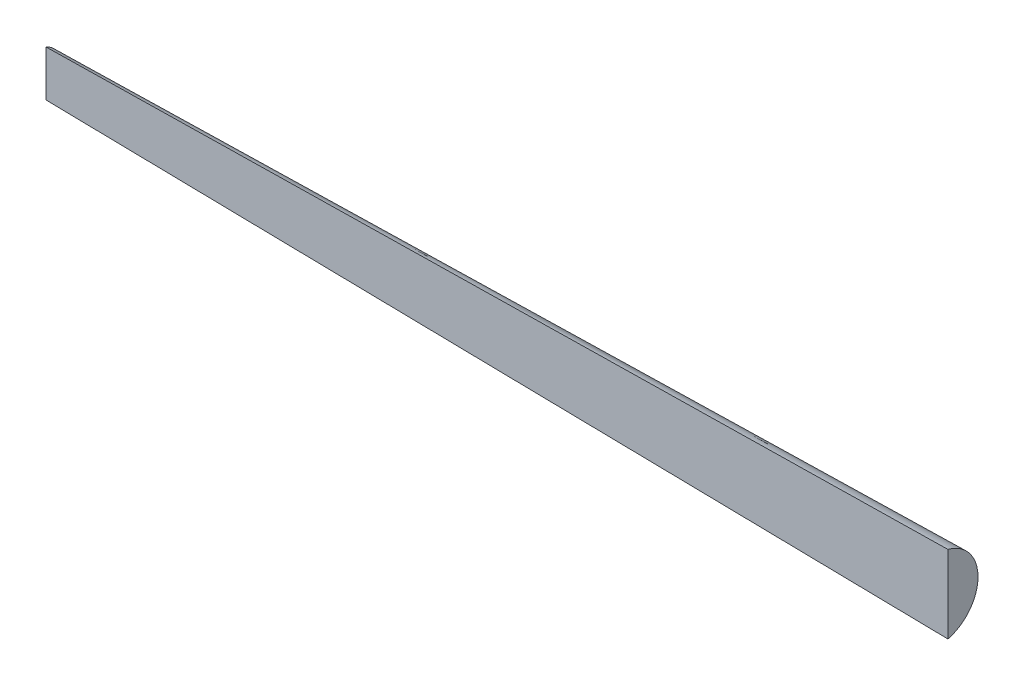
ISO-10303-21;
HEADER;
FILE_DESCRIPTION(('STEP AP214'),'2;1');
FILE_NAME('part.step','',(''),(''),'','','');
FILE_SCHEMA(('AUTOMOTIVE_DESIGN { 1 0 10303 214 1 1 1 1 }'));
ENDSEC;
DATA;
#1=APPLICATION_CONTEXT('core data for automotive mechanical design processes');
#2=APPLICATION_PROTOCOL_DEFINITION('international standard','automotive_design',2000,#1);
#3=PRODUCT_CONTEXT('',#1,'mechanical');
#4=PRODUCT('Part','Part','',(#3));
#5=PRODUCT_RELATED_PRODUCT_CATEGORY('part','',(#4));
#6=PRODUCT_DEFINITION_FORMATION('','',#4);
#7=PRODUCT_DEFINITION_CONTEXT('part definition',#1,'design');
#8=PRODUCT_DEFINITION('design','',#6,#7);
#9=PRODUCT_DEFINITION_SHAPE('','',#8);
#10=(LENGTH_UNIT() NAMED_UNIT(*) SI_UNIT(.MILLI.,.METRE.));
#11=(NAMED_UNIT(*) PLANE_ANGLE_UNIT() SI_UNIT($,.RADIAN.));
#12=(NAMED_UNIT(*) SI_UNIT($,.STERADIAN.) SOLID_ANGLE_UNIT());
#13=UNCERTAINTY_MEASURE_WITH_UNIT(LENGTH_MEASURE(1.E-05),#10,'distance_accuracy_value','');
#14=(GEOMETRIC_REPRESENTATION_CONTEXT(3) GLOBAL_UNCERTAINTY_ASSIGNED_CONTEXT((#13)) GLOBAL_UNIT_ASSIGNED_CONTEXT((#10,
#11,#12)) REPRESENTATION_CONTEXT('',''));
#15=CARTESIAN_POINT('',(0.,0.,0.));
#16=DIRECTION('',(0.,0.,1.));
#17=DIRECTION('',(1.,0.,0.));
#18=AXIS2_PLACEMENT_3D('',#15,#16,#17);
#19=CARTESIAN_POINT('',(-10.5482343550447,3.87298334620742,-1.));
#20=DIRECTION('',(0.,0.,1.));
#21=DIRECTION('',(1.,0.,0.));
#22=AXIS2_PLACEMENT_3D('',#19,#20,#21);
#23=PLANE('',#22);
#24=CARTESIAN_POINT('',(169.794683970045,-5.41396950616258,-1.));
#25=CARTESIAN_POINT('',(167.989839614109,-5.38337995232851,-1.));
#26=CARTESIAN_POINT('',(166.184995403355,-5.35278183613073,-1.));
#27=CARTESIAN_POINT('',(162.575310363749,-5.2915676490939,-1.));
#28=CARTESIAN_POINT('',(160.770469534898,-5.26095157828555,-1.));
#29=CARTESIAN_POINT('',(151.746276416087,-5.10782417565176,-1.));
#30=CARTESIAN_POINT('',(144.526926528888,-4.98517117799231,-1.));
#31=CARTESIAN_POINT('',(133.697889938503,-4.80090990606002,-1.));
#32=CARTESIAN_POINT('',(130.088200840633,-4.73944237828421,-1.));
#33=CARTESIAN_POINT('',(122.868824791072,-4.61640030939844,-1.));
#34=CARTESIAN_POINT('',(119.259137839381,-4.55482576829798,-1.));
#35=CARTESIAN_POINT('',(101.210465767827,-4.24666057540859,-1.));
#36=CARTESIAN_POINT('',(86.7714953657213,-3.99920483752035,-1.));
#37=CARTESIAN_POINT('',(65.1130760511869,-3.62560878910917,-1.));
#38=CARTESIAN_POINT('',(57.893606336903,-3.50067465294227,-1.));
#39=CARTESIAN_POINT('',(43.4546867264623,-3.24968911025287,-1.));
#40=CARTESIAN_POINT('',(36.2352368303045,-3.12363770379593,-1.));
#41=CARTESIAN_POINT('',(21.7966302790209,-2.86994984848068,-1.));
#42=CARTESIAN_POINT('',(14.5774736228694,-2.74231345804627,-1.));
#43=CARTESIAN_POINT('',(0.139200719295253,-2.48467406720731,-1.));
#44=CARTESIAN_POINT('',(-7.07991552811785,-2.35467106626868,-1.));
#45=CARTESIAN_POINT('',(-17.9085297130551,-2.15676068122826,-1.));
#46=CARTESIAN_POINT('',(-21.5180541846002,-2.09030630590136,-1.));
#47=CARTESIAN_POINT('',(-28.7370789404546,-1.95609798993977,-1.));
#48=CARTESIAN_POINT('',(-32.3465792247644,-1.88834404933697,-1.));
#49=CARTESIAN_POINT('',(-39.5655446751145,-1.75105725691833,-1.));
#50=CARTESIAN_POINT('',(-43.1750098411672,-1.68152440575912,-1.));
#51=CARTESIAN_POINT('',(-50.3938902459588,-1.53991824182742,-1.));
#52=CARTESIAN_POINT('',(-54.0033054847046,-1.46784492940961,-1.));
#53=CARTESIAN_POINT('',(-58.6846145945536,-1.37181320967856,-1.));
#54=CARTESIAN_POINT('',(-59.7565452971218,-1.3496500419319,-1.));
#55=CARTESIAN_POINT('',(-61.9003981748795,-1.30491348411191,-1.));
#56=CARTESIAN_POINT('',(-62.9723203500688,-1.28234009402678,-1.));
#57=CARTESIAN_POINT('',(-66.1880767361368,-1.21390787877872,-1.));
#58=CARTESIAN_POINT('',(-68.3318958589267,-1.1673371095463,-1.));
#59=CARTESIAN_POINT('',(-72.6197047333831,-1.07152223069259,-1.));
#60=CARTESIAN_POINT('',(-74.7636944787349,-1.0222778353051,-1.));
#61=CARTESIAN_POINT('',(-77.97959912611,-0.94532894858339,-1.));
#62=CARTESIAN_POINT('',(-79.0515508237185,-0.919165686510742,-1.));
#63=CARTESIAN_POINT('',(-81.1954205030291,-0.865501045327211,-1.));
#64=CARTESIAN_POINT('',(-82.2673384847416,-0.837999666635325,-1.));
#65=CARTESIAN_POINT('',(-84.4112285828296,-0.781217568239729,-1.));
#66=CARTESIAN_POINT('',(-85.4832006948256,-0.751936681561685,-1.));
#67=CARTESIAN_POINT('',(-87.6270900329157,-0.690860546293062,-1.));
#68=CARTESIAN_POINT('',(-88.6990072579037,-0.659065258797805,-1.));
#69=CARTESIAN_POINT('',(-90.8424766665863,-0.59172914223937,-1.));
#70=CARTESIAN_POINT('',(-91.9140288769663,-0.556189192478692,-1.));
#71=CARTESIAN_POINT('',(-93.5211599779759,-0.497863975221129,-1.));
#72=CARTESIAN_POINT('',(-94.0568294167229,-0.477586696893234,-1.));
#73=CARTESIAN_POINT('',(-95.1280687531725,-0.434582022130653,-1.));
#74=CARTESIAN_POINT('',(-95.6636386515507,-0.411854642983068,-1.));
#75=CARTESIAN_POINT('',(-96.4668368592549,-0.37476390424584,-1.));
#76=CARTESIAN_POINT('',(-96.7345339455965,-0.361900891815799,-1.));
#77=CARTESIAN_POINT('',(-97.2698676630343,-0.334779777424074,-1.));
#78=CARTESIAN_POINT('',(-97.5375042915742,-0.320521624678139,-1.));
#79=CARTESIAN_POINT('',(-98.0728340994095,-0.289976777955135,-1.));
#80=CARTESIAN_POINT('',(-98.3405272085035,-0.273688814500363,-1.));
#81=CARTESIAN_POINT('',(-98.7418937157164,-0.246676238255826,-1.));
#82=CARTESIAN_POINT('',(-98.8756526903427,-0.237242021363846,-1.));
#83=CARTESIAN_POINT('',(-99.1430681282006,-0.217122405389946,-1.));
#84=CARTESIAN_POINT('',(-99.2767245970363,-0.206437080472545,-1.));
#85=CARTESIAN_POINT('',(-99.5439843579973,-0.183174844520769,-1.));
#86=CARTESIAN_POINT('',(-99.6775875363529,-0.170596530405749,-1.));
#87=CARTESIAN_POINT('',(-99.8776105947947,-0.148962200221205,-1.));
#88=CARTESIAN_POINT('',(-99.9441808562951,-0.141295129877039,-1.));
#89=CARTESIAN_POINT('',(-100.077135842162,-0.124510678470939,-1.));
#90=CARTESIAN_POINT('',(-100.143520609558,-0.115393668187864,-1.));
#91=CARTESIAN_POINT('',(-100.242793310137,-0.0994888818422357,-1.));
#92=CARTESIAN_POINT('',(-100.275859159114,-0.0938104361364083,-1.));
#93=CARTESIAN_POINT('',(-100.341755526412,-0.0812574003207791,-1.));
#94=CARTESIAN_POINT('',(-100.374586220362,-0.0743838275828005,-1.));
#95=CARTESIAN_POINT('',(-100.423408322767,-0.0620211709040358,-1.));
#96=CARTESIAN_POINT('',(-100.439649341622,-0.0575452907579698,-1.));
#97=CARTESIAN_POINT('',(-100.471728336624,-0.0474005174480523,-1.));
#98=CARTESIAN_POINT('',(-100.487567295083,-0.0417349263800099,-1.));
#99=CARTESIAN_POINT('',(-100.510337424145,-0.0307301314121669,-1.));
#100=CARTESIAN_POINT('',(-100.517767554612,-0.0266404267428354,-1.));
#101=CARTESIAN_POINT('',(-100.525689336395,-0.0204714837199477,-1.));
#102=CARTESIAN_POINT('',(-100.526947704176,-0.0194275534353475,-1.));
#103=CARTESIAN_POINT('',(-100.52936900787,-0.0172273168782211,-1.));
#104=CARTESIAN_POINT('',(-100.53053170734,-0.0160707467478265,-1.));
#105=CARTESIAN_POINT('',(-100.532725208906,-0.013608117170764,-1.));
#106=CARTESIAN_POINT('',(-100.533754062956,-0.0123002827587059,-1.));
#107=CARTESIAN_POINT('',(-100.535569110515,-0.00952592870985733,-1.));
#108=CARTESIAN_POINT('',(-100.536356450463,-0.00806020484786752,-1.));
#109=CARTESIAN_POINT('',(-100.537319327538,-0.00559918132107379,-1.));
#110=CARTESIAN_POINT('',(-100.537613596069,-0.00465080404739843,-1.));
#111=CARTESIAN_POINT('',(-100.538040550538,-0.00271834976598261,-1.));
#112=CARTESIAN_POINT('',(-100.5381734354,-0.0017343182511746,-1.));
#113=CARTESIAN_POINT('',(-100.53826201573,0.000245265912749585,-1.));
#114=CARTESIAN_POINT('',(-100.538217114609,0.00124084615614494,-1.));
#115=CARTESIAN_POINT('',(-100.537954565999,0.00320909733218003,-1.));
#116=CARTESIAN_POINT('',(-100.537736744189,0.00418174412654007,-1.));
#117=CARTESIAN_POINT('',(-100.537073435737,0.00633661089274777,-1.));
#118=CARTESIAN_POINT('',(-100.536582386727,0.00750458968220141,-1.));
#119=CARTESIAN_POINT('',(-100.535421875212,0.00974768049927335,-1.));
#120=CARTESIAN_POINT('',(-100.53475200791,0.0108225744032647,-1.));
#121=CARTESIAN_POINT('',(-100.53273104811,0.0136662341240459,-1.));
#122=CARTESIAN_POINT('',(-100.531249390737,0.0153407843768321,-1.));
#123=CARTESIAN_POINT('',(-100.528072261838,0.0184707307457689,-1.));
#124=CARTESIAN_POINT('',(-100.526376105931,0.019925391136548,-1.));
#125=CARTESIAN_POINT('',(-100.518898485794,0.0257959083841306,-1.));
#126=CARTESIAN_POINT('',(-100.512552831915,0.0294688767992095,-1.));
#127=CARTESIAN_POINT('',(-100.499491179853,0.0360758691554241,-1.));
#128=CARTESIAN_POINT('',(-100.492772833214,0.0390043512159379,-1.));
#129=CARTESIAN_POINT('',(-100.454249464069,0.0545420178182804,-1.));
#130=CARTESIAN_POINT('',(-100.420925638385,0.0632064180244524,-1.));
#131=CARTESIAN_POINT('',(-100.354057075325,0.0786537081514288,-1.));
#132=CARTESIAN_POINT('',(-100.320512245368,0.0854357504535867,-1.));
#133=CARTESIAN_POINT('',(-100.220060069923,0.103935993715912,-1.));
#134=CARTESIAN_POINT('',(-100.152792481061,0.113947586855176,-1.));
#135=CARTESIAN_POINT('',(-100.018023245588,0.132232583644573,-1.));
#136=CARTESIAN_POINT('',(-99.9505214333566,0.140504259594359,-1.));
#137=CARTESIAN_POINT('',(-99.8154429007653,0.155880649069516,-1.));
#138=CARTESIAN_POINT('',(-99.7478663342435,0.162986582835588,-1.));
#139=CARTESIAN_POINT('',(-99.612672023915,0.176444193069986,-1.));
#140=CARTESIAN_POINT('',(-99.5450543088181,0.182796181199141,-1.));
#141=CARTESIAN_POINT('',(-99.3423096890582,0.201012882889378,-1.));
#142=CARTESIAN_POINT('',(-99.2071083186195,0.212057770058193,-1.));
#143=CARTESIAN_POINT('',(-98.9366021664084,0.232808952833941,-1.));
#144=CARTESIAN_POINT('',(-98.8012973811536,0.242515201167413,-1.));
#145=CARTESIAN_POINT('',(-98.3952247624725,0.270252375663938,-1.));
#146=CARTESIAN_POINT('',(-98.1243624462042,0.286896498928191,-1.));
#147=CARTESIAN_POINT('',(-97.5824553981614,0.318071211391438,-1.));
#148=CARTESIAN_POINT('',(-97.311410638099,0.332601287883391,-1.));
#149=CARTESIAN_POINT('',(-96.7692764082151,0.36020471364438,-1.));
#150=CARTESIAN_POINT('',(-96.4981869463461,0.373278219540423,-1.));
#151=CARTESIAN_POINT('',(-95.6850831381377,0.410935749511971,-1.));
#152=CARTESIAN_POINT('',(-95.1429976311429,0.433969507146761,-1.));
#153=CARTESIAN_POINT('',(-94.0587244653016,0.477523284605589,-1.));
#154=CARTESIAN_POINT('',(-93.5165368057546,0.498043286510054,-1.));
#155=CARTESIAN_POINT('',(-91.8898177517276,0.557043827179673,-1.));
#156=CARTESIAN_POINT('',(-90.8051939336687,0.592962190670438,-1.));
#157=CARTESIAN_POINT('',(-88.636033266063,0.66098066548518,-1.));
#158=CARTESIAN_POINT('',(-87.5514964380467,0.693081487955822,-1.));
#159=CARTESIAN_POINT('',(-85.3823784082722,0.754735654080724,-1.));
#160=CARTESIAN_POINT('',(-84.297797208371,0.78428906319074,-1.));
#161=CARTESIAN_POINT('',(-82.1286203311323,0.841598585624071,-1.));
#162=CARTESIAN_POINT('',(-81.0440246552038,0.869354752804462,-1.));
#163=CARTESIAN_POINT('',(-78.8747994703156,0.92351588262553,-1.));
#164=CARTESIAN_POINT('',(-77.7901699613493,0.949920845001968,-1.));
#165=CARTESIAN_POINT('',(-74.5362422045236,1.02758156240213,-1.));
#166=CARTESIAN_POINT('',(-72.3669069436677,1.07728309054754,-1.));
#167=CARTESIAN_POINT('',(-68.0281483283577,1.17399883814358,-1.));
#168=CARTESIAN_POINT('',(-65.8587249731155,1.22101302183095,-1.));
#169=CARTESIAN_POINT('',(-61.5198391380561,1.31313587430159,-1.));
#170=CARTESIAN_POINT('',(-59.3503766582618,1.35824454416678,-1.));
#171=CARTESIAN_POINT('',(-55.0112926275027,1.4470583856433,-1.));
#172=CARTESIAN_POINT('',(-52.8416710748143,1.49076347273517,-1.));
#173=CARTESIAN_POINT('',(-48.5024062423955,1.57709516485232,-1.));
#174=CARTESIAN_POINT('',(-46.3327629626621,1.619721769724,-1.));
#175=CARTESIAN_POINT('',(-41.9934715185899,1.70412604792437,-1.));
#176=CARTESIAN_POINT('',(-39.8238233543394,1.74590372578976,-1.));
#177=CARTESIAN_POINT('',(-35.4845140871,1.82877475042546,-1.));
#178=CARTESIAN_POINT('',(-33.3148529841119,1.86986809723168,-1.));
#179=CARTESIAN_POINT('',(-26.9632490291458,1.98935333530347,-1.));
#180=CARTESIAN_POINT('',(-22.7812919827584,2.06699050877283,-1.));
#181=CARTESIAN_POINT('',(-14.4173509768323,2.22080288766058,-1.));
#182=CARTESIAN_POINT('',(-10.235367017293,2.29697809303911,-1.));
#183=CARTESIAN_POINT('',(2.31061456193886,2.52390380467986,-1.));
#184=CARTESIAN_POINT('',(10.6746410968632,2.67305439184086,-1.));
#185=CARTESIAN_POINT('',(27.4027570202101,2.96883999194831,-1.));
#186=CARTESIAN_POINT('',(35.766846408731,3.11547499930795,-1.));
#187=CARTESIAN_POINT('',(52.49505356973,3.40709053394367,-1.));
#188=CARTESIAN_POINT('',(60.8591713422066,3.55207106130699,-1.));
#189=CARTESIAN_POINT('',(77.5872541841885,3.8408927548217,-1.));
#190=CARTESIAN_POINT('',(85.9512192532901,3.98473394438213,-1.));
#191=CARTESIAN_POINT('',(102.679163582132,4.2715948488924,-1.));
#192=CARTESIAN_POINT('',(111.043142841872,4.41461456383133,-1.));
#193=CARTESIAN_POINT('',(136.135087409552,4.84276815405861,-1.));
#194=CARTESIAN_POINT('',(152.86306816586,5.12699662377515,-1.));
#195=CARTESIAN_POINT('',(169.658935234324,5.41166874405432,-1.));
#196=CARTESIAN_POINT('',(169.726809602086,5.41281913090955,-1.));
#197=CARTESIAN_POINT('',(169.794683970045,5.41396950616261,-1.));
#198=B_SPLINE_CURVE_WITH_KNOTS('',3,(#24,#25,#26,#27,#28,#29,#30,#31,#32,#33,#34,#35,#36,#37,
#38,#39,#40,#41,#42,#43,#44,#45,#46,#47,#48,#49,#50,#51,#52,#53,#54,#55,#56,#57,#58,#59,#60,#61,
#62,#63,#64,#65,#66,#67,#68,#69,#70,#71,#72,#73,#74,#75,#76,#77,#78,#79,#80,#81,#82,#83,#84,#85,
#86,#87,#88,#89,#90,#91,#92,#93,#94,#95,#96,#97,#98,#99,#100,#101,#102,#103,#104,#105,#106,#107,
#108,#109,#110,#111,#112,#113,#114,#115,#116,#117,#118,#119,#120,#121,#122,#123,#124,#125,#126,
#127,#128,#129,#130,#131,#132,#133,#134,#135,#136,#137,#138,#139,#140,#141,#142,#143,#144,#145,
#146,#147,#148,#149,#150,#151,#152,#153,#154,#155,#156,#157,#158,#159,#160,#161,#162,#163,#164,
#165,#166,#167,#168,#169,#170,#171,#172,#173,#174,#175,#176,#177,#178,#179,#180,#181,#182,#183,
#184,#185,#186,#187,#188,#189,#190,#191,#192,#193,#194,#195,#196,#197),.UNSPECIFIED.,.F.,.F.,(4,
2,2,2,2,2,2,2,2,2,2,2,2,2,2,2,2,2,2,2,2,2,2,2,2,2,2,2,2,2,2,2,2,2,2,2,2,2,2,2,2,2,2,2,2,2,2,2,2,
2,2,2,2,2,2,2,2,2,2,2,2,2,2,2,2,2,2,2,2,2,2,2,2,2,2,2,2,2,2,2,2,2,2,2,2,2,4),(0.,
5.41531068619407,10.8306121414516,32.4917872844905,43.322424510106,54.1530607738129,
97.4763325910826,119.137984447409,140.799635032771,162.460489506966,184.121348869475,
194.951757192533,205.782165249767,216.612569309293,227.442971856787,230.659451191489,
233.875930618732,240.308904322069,246.742566962182,249.959379137439,253.176190305438,
256.393303779857,259.610467041589,262.826876541937,264.435032894409,266.043177901005,
266.847193066207,267.651237509114,268.455787362611,268.858056260405,269.260301324135,
269.662846013173,269.863873365931,270.064849394359,270.165494650104,270.266054645649,
270.31657250012,270.366951950729,270.392176660858,270.397076176298,270.401987458266,
270.406963702432,270.411915945765,270.414883234443,270.417846861853,270.420820442578,
270.423797024744,270.427576529015,270.43136466271,270.438034594649,270.444726371629,
270.466551500468,270.488534626555,270.591250739011,270.694013029379,270.897857174957,
271.101902787703,271.305733433744,271.509479526054,271.916419710651,272.323374262488,
273.137475330701,273.951773510007,274.765984042045,276.393696886604,278.021421333811,
281.277061352574,284.532093944661,287.787042873777,291.041894218237,294.296746199206,
300.806456814134,307.316254040354,313.826047570317,320.336232367876,326.846418092613,
333.35656901739,339.866719600486,352.414752112627,364.962784966892,390.058853031974,
415.154976825226,440.251099294923,465.346704790381,490.442310618713,540.633496291801,
540.837148639447),.UNSPECIFIED.);
#199=CARTESIAN_POINT('',(79.4617656449553,-3.87298334620741,-1.));
#200=VERTEX_POINT('',#199);
#201=CARTESIAN_POINT('',(-10.5382343550447,-2.29128784747792,-1.));
#202=VERTEX_POINT('',#201);
#203=EDGE_CURVE('E66',#200,#202,#198,.T.);
#204=ORIENTED_EDGE('',*,*,#203,.F.);
#205=DIRECTION('',(0.,-1.,0.));
#206=VECTOR('',#205,1.);
#207=CARTESIAN_POINT('',(79.4617656449553,4.00000000000001,-1.));
#208=LINE('',#207,#206);
#209=CARTESIAN_POINT('',(79.4617656449553,3.87298334620742,-1.));
#210=VERTEX_POINT('',#209);
#211=EDGE_CURVE('E38',#210,#200,#208,.T.);
#212=ORIENTED_EDGE('',*,*,#211,.F.);
#213=CARTESIAN_POINT('',(-10.5382343550447,2.29128784747792,-1.));
#214=VERTEX_POINT('',#213);
#215=EDGE_CURVE('E59',#214,#210,#198,.T.);
#216=ORIENTED_EDGE('',*,*,#215,.F.);
#217=DIRECTION('',(0.,1.,0.));
#218=VECTOR('',#217,1.);
#219=CARTESIAN_POINT('',(-10.5382343550447,0.,-1.));
#220=LINE('',#219,#218);
#221=EDGE_CURVE('E61',#202,#214,#220,.T.);
#222=ORIENTED_EDGE('',*,*,#221,.F.);
#223=EDGE_LOOP('',(#204,#212,#216,#222));
#224=FACE_BOUND('',#223,.T.);
#225=ADVANCED_FACE('F33',(#224),#23,.T.);
#226=CARTESIAN_POINT('',(79.4617656449553,4.00000000000001,0.));
#227=DIRECTION('',(1.,0.,0.));
#228=DIRECTION('',(0.,1.,0.));
#229=AXIS2_PLACEMENT_3D('',#226,#227,#228);
#230=PLANE('',#229);
#231=CARTESIAN_POINT('',(79.4617656449553,0.,0.));
#232=DIRECTION('',(1.,0.,0.));
#233=DIRECTION('',(0.,1.,0.));
#234=AXIS2_PLACEMENT_3D('',#231,#232,#233);
#235=CIRCLE('',#234,4.);
#236=EDGE_CURVE('E12',#200,#210,#235,.T.);
#237=ORIENTED_EDGE('',*,*,#236,.T.);
#238=ORIENTED_EDGE('',*,*,#211,.T.);
#239=EDGE_LOOP('',(#237,#238));
#240=FACE_BOUND('',#239,.T.);
#241=ADVANCED_FACE('F79',(#240),#230,.T.);
#242=CARTESIAN_POINT('',(-10.5382343550447,0.,0.));
#243=DIRECTION('',(-1.,0.,0.));
#244=DIRECTION('',(0.,-1.,0.));
#245=AXIS2_PLACEMENT_3D('',#242,#243,#244);
#246=PLANE('',#245);
#247=CARTESIAN_POINT('',(-10.5382343550447,0.,0.));
#248=DIRECTION('',(1.,0.,0.));
#249=DIRECTION('',(0.,1.,0.));
#250=AXIS2_PLACEMENT_3D('',#247,#248,#249);
#251=CIRCLE('',#250,2.5);
#252=EDGE_CURVE('E43',#202,#214,#251,.T.);
#253=ORIENTED_EDGE('',*,*,#252,.F.);
#254=ORIENTED_EDGE('',*,*,#221,.T.);
#255=EDGE_LOOP('',(#253,#254));
#256=FACE_BOUND('',#255,.T.);
#257=ADVANCED_FACE('F68',(#256),#246,.T.);
#258=CARTESIAN_POINT('',(79.4617656449553,0.,0.));
#259=DIRECTION('',(1.,0.,0.));
#260=DIRECTION('',(0.,1.,0.));
#261=AXIS2_PLACEMENT_3D('',#258,#259,#260);
#262=CONICAL_SURFACE('',#261,4.,0.0166651237139408);
#263=ORIENTED_EDGE('',*,*,#236,.F.);
#264=ORIENTED_EDGE('',*,*,#203,.T.);
#265=ORIENTED_EDGE('',*,*,#252,.T.);
#266=ORIENTED_EDGE('',*,*,#215,.T.);
#267=EDGE_LOOP('',(#263,#264,#265,#266));
#268=FACE_BOUND('',#267,.T.);
#269=ADVANCED_FACE('F35',(#268),#262,.T.);
#270=CLOSED_SHELL('',(#225,#241,#257,#269));
#271=MANIFOLD_SOLID_BREP('B2',#270);
#272=ADVANCED_BREP_SHAPE_REPRESENTATION('',(#18,#271),#14);
#273=SHAPE_DEFINITION_REPRESENTATION(#9,#272);
ENDSEC;
END-ISO-10303-21;
